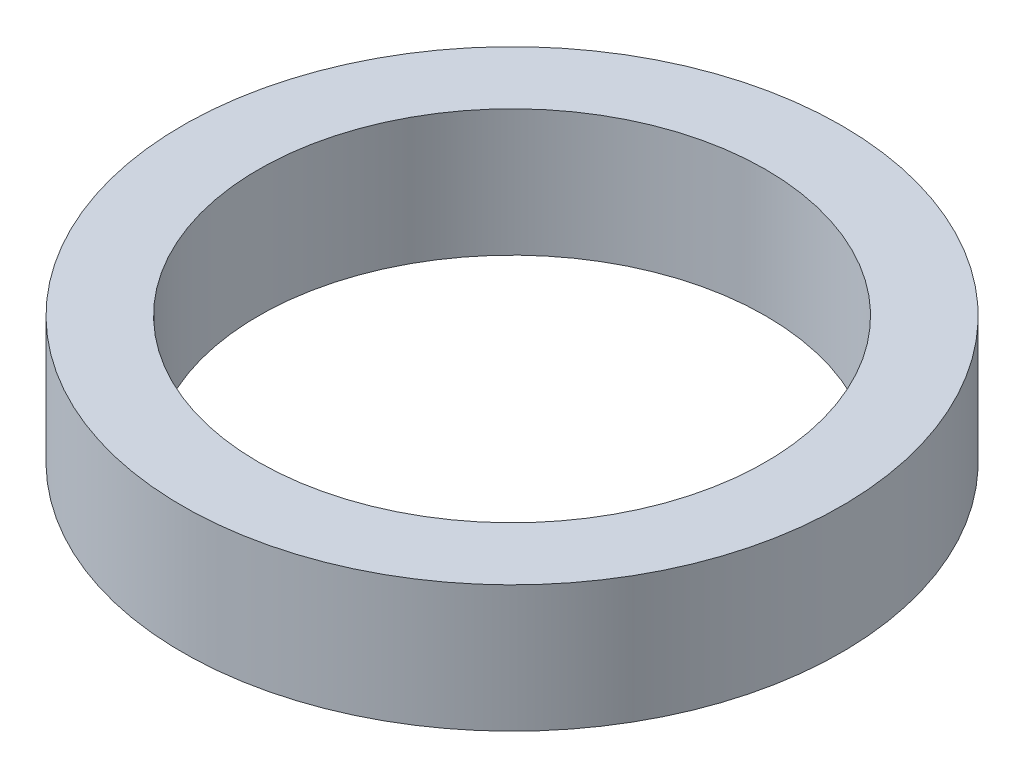
ISO-10303-21;
HEADER;
FILE_DESCRIPTION(('STEP AP214'),'2;1');
FILE_NAME('part.step','',(''),(''),'','','');
FILE_SCHEMA(('AUTOMOTIVE_DESIGN { 1 0 10303 214 1 1 1 1 }'));
ENDSEC;
DATA;
#1=APPLICATION_CONTEXT('core data for automotive mechanical design processes');
#2=APPLICATION_PROTOCOL_DEFINITION('international standard','automotive_design',2000,#1);
#3=PRODUCT_CONTEXT('',#1,'mechanical');
#4=PRODUCT('Part','Part','',(#3));
#5=PRODUCT_RELATED_PRODUCT_CATEGORY('part','',(#4));
#6=PRODUCT_DEFINITION_FORMATION('','',#4);
#7=PRODUCT_DEFINITION_CONTEXT('part definition',#1,'design');
#8=PRODUCT_DEFINITION('design','',#6,#7);
#9=PRODUCT_DEFINITION_SHAPE('','',#8);
#10=(LENGTH_UNIT() NAMED_UNIT(*) SI_UNIT(.MILLI.,.METRE.));
#11=(NAMED_UNIT(*) PLANE_ANGLE_UNIT() SI_UNIT($,.RADIAN.));
#12=(NAMED_UNIT(*) SI_UNIT($,.STERADIAN.) SOLID_ANGLE_UNIT());
#13=UNCERTAINTY_MEASURE_WITH_UNIT(LENGTH_MEASURE(1.E-05),#10,'distance_accuracy_value','');
#14=(GEOMETRIC_REPRESENTATION_CONTEXT(3) GLOBAL_UNCERTAINTY_ASSIGNED_CONTEXT((#13)) GLOBAL_UNIT_ASSIGNED_CONTEXT((#10,
#11,#12)) REPRESENTATION_CONTEXT('',''));
#15=CARTESIAN_POINT('',(0.,0.,0.));
#16=DIRECTION('',(0.,0.,1.));
#17=DIRECTION('',(1.,0.,0.));
#18=AXIS2_PLACEMENT_3D('',#15,#16,#17);
#19=CARTESIAN_POINT('',(0.,1.,0.));
#20=DIRECTION('',(0.,1.,0.));
#21=DIRECTION('',(0.,0.,-1.));
#22=AXIS2_PLACEMENT_3D('',#19,#20,#21);
#23=PLANE('',#22);
#24=CARTESIAN_POINT('',(0.,1.,0.));
#25=DIRECTION('',(0.,-1.,0.));
#26=DIRECTION('',(0.,0.,-1.));
#27=AXIS2_PLACEMENT_3D('',#24,#25,#26);
#28=CIRCLE('',#27,2.6);
#29=CARTESIAN_POINT('',(0.,1.,-2.6));
#30=VERTEX_POINT('',#29);
#31=EDGE_CURVE('E10',#30,#30,#28,.T.);
#32=ORIENTED_EDGE('',*,*,#31,.F.);
#33=EDGE_LOOP('',(#32));
#34=FACE_BOUND('',#33,.T.);
#35=CARTESIAN_POINT('',(0.,1.,0.));
#36=DIRECTION('',(0.,-1.,0.));
#37=DIRECTION('',(0.,0.,-1.));
#38=AXIS2_PLACEMENT_3D('',#35,#36,#37);
#39=CIRCLE('',#38,2.);
#40=CARTESIAN_POINT('',(0.,1.,-2.));
#41=VERTEX_POINT('',#40);
#42=EDGE_CURVE('E48',#41,#41,#39,.T.);
#43=ORIENTED_EDGE('',*,*,#42,.T.);
#44=EDGE_LOOP('',(#43));
#45=FACE_BOUND('',#44,.T.);
#46=ADVANCED_FACE('F37',(#34,#45),#23,.T.);
#47=CARTESIAN_POINT('',(0.,0.,0.));
#48=DIRECTION('',(0.,1.,0.));
#49=DIRECTION('',(0.,0.,-1.));
#50=AXIS2_PLACEMENT_3D('',#47,#48,#49);
#51=PLANE('',#50);
#52=CARTESIAN_POINT('',(0.,0.,0.));
#53=DIRECTION('',(0.,-1.,0.));
#54=DIRECTION('',(0.,0.,-1.));
#55=AXIS2_PLACEMENT_3D('',#52,#53,#54);
#56=CIRCLE('',#55,2.6);
#57=CARTESIAN_POINT('',(0.,0.,-2.6));
#58=VERTEX_POINT('',#57);
#59=EDGE_CURVE('E41',#58,#58,#56,.T.);
#60=ORIENTED_EDGE('',*,*,#59,.T.);
#61=EDGE_LOOP('',(#60));
#62=FACE_BOUND('',#61,.T.);
#63=CARTESIAN_POINT('',(0.,0.,0.));
#64=DIRECTION('',(0.,-1.,0.));
#65=DIRECTION('',(0.,0.,-1.));
#66=AXIS2_PLACEMENT_3D('',#63,#64,#65);
#67=CIRCLE('',#66,2.);
#68=CARTESIAN_POINT('',(0.,0.,-2.));
#69=VERTEX_POINT('',#68);
#70=EDGE_CURVE('E50',#69,#69,#67,.T.);
#71=ORIENTED_EDGE('',*,*,#70,.F.);
#72=EDGE_LOOP('',(#71));
#73=FACE_BOUND('',#72,.T.);
#74=ADVANCED_FACE('F63',(#62,#73),#51,.F.);
#75=CARTESIAN_POINT('',(0.,1.,0.));
#76=DIRECTION('',(0.,-1.,0.));
#77=DIRECTION('',(0.,0.,1.));
#78=AXIS2_PLACEMENT_3D('',#75,#76,#77);
#79=CYLINDRICAL_SURFACE('',#78,2.6);
#80=ORIENTED_EDGE('',*,*,#31,.T.);
#81=EDGE_LOOP('',(#80));
#82=FACE_BOUND('',#81,.T.);
#83=ORIENTED_EDGE('',*,*,#59,.F.);
#84=EDGE_LOOP('',(#83));
#85=FACE_BOUND('',#84,.T.);
#86=ADVANCED_FACE('F39',(#82,#85),#79,.T.);
#87=CARTESIAN_POINT('',(0.,1.,0.));
#88=DIRECTION('',(0.,-1.,0.));
#89=DIRECTION('',(0.,0.,1.));
#90=AXIS2_PLACEMENT_3D('',#87,#88,#89);
#91=CYLINDRICAL_SURFACE('',#90,2.);
#92=ORIENTED_EDGE('',*,*,#42,.F.);
#93=EDGE_LOOP('',(#92));
#94=FACE_BOUND('',#93,.T.);
#95=ORIENTED_EDGE('',*,*,#70,.T.);
#96=EDGE_LOOP('',(#95));
#97=FACE_BOUND('',#96,.T.);
#98=ADVANCED_FACE('F57',(#94,#97),#91,.F.);
#99=CLOSED_SHELL('',(#46,#74,#86,#98));
#100=MANIFOLD_SOLID_BREP('B2',#99);
#101=ADVANCED_BREP_SHAPE_REPRESENTATION('',(#18,#100),#14);
#102=SHAPE_DEFINITION_REPRESENTATION(#9,#101);
ENDSEC;
END-ISO-10303-21;
